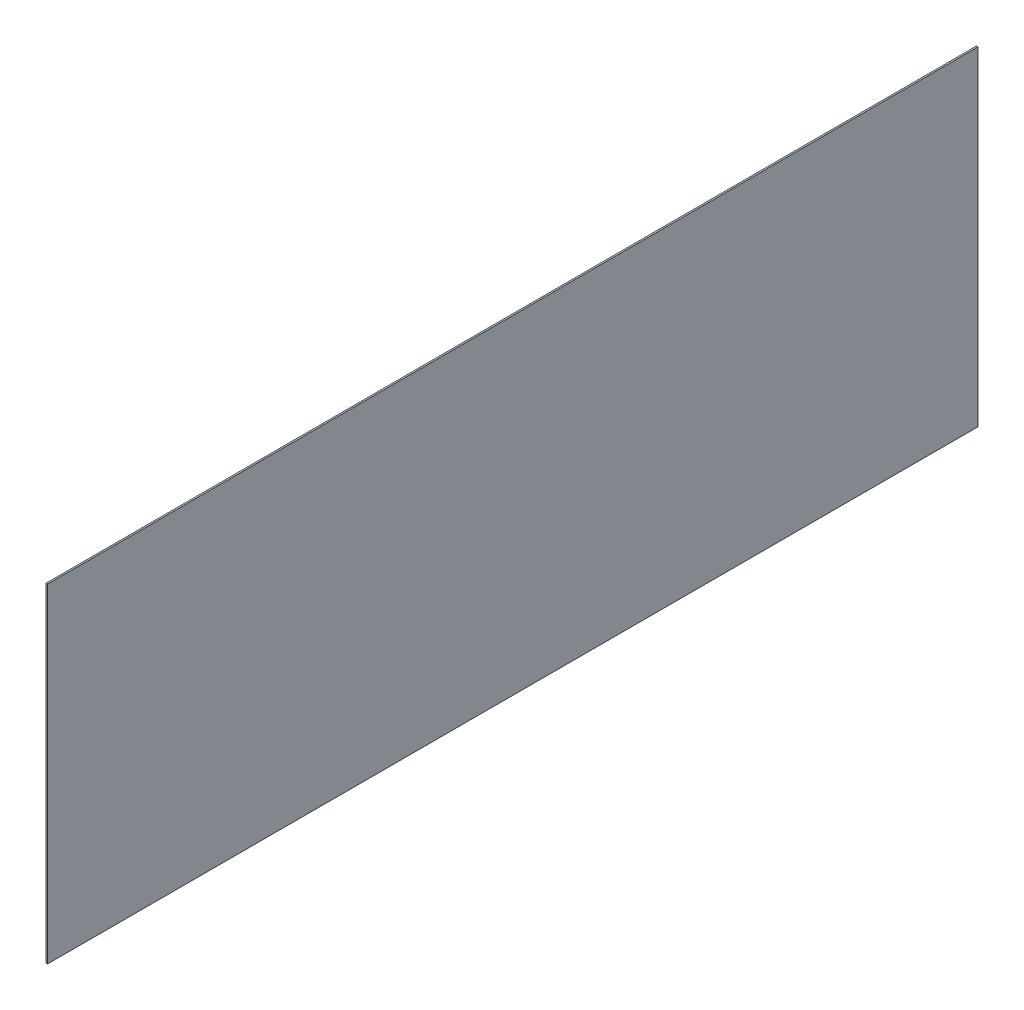
ISO-10303-21;
HEADER;
FILE_DESCRIPTION(('STEP AP214'),'2;1');
FILE_NAME('part.step','',(''),(''),'','','');
FILE_SCHEMA(('AUTOMOTIVE_DESIGN { 1 0 10303 214 1 1 1 1 }'));
ENDSEC;
DATA;
#1=APPLICATION_CONTEXT('core data for automotive mechanical design processes');
#2=APPLICATION_PROTOCOL_DEFINITION('international standard','automotive_design',2000,#1);
#3=PRODUCT_CONTEXT('',#1,'mechanical');
#4=PRODUCT('Part','Part','',(#3));
#5=PRODUCT_RELATED_PRODUCT_CATEGORY('part','',(#4));
#6=PRODUCT_DEFINITION_FORMATION('','',#4);
#7=PRODUCT_DEFINITION_CONTEXT('part definition',#1,'design');
#8=PRODUCT_DEFINITION('design','',#6,#7);
#9=PRODUCT_DEFINITION_SHAPE('','',#8);
#10=(LENGTH_UNIT() NAMED_UNIT(*) SI_UNIT(.MILLI.,.METRE.));
#11=(NAMED_UNIT(*) PLANE_ANGLE_UNIT() SI_UNIT($,.RADIAN.));
#12=(NAMED_UNIT(*) SI_UNIT($,.STERADIAN.) SOLID_ANGLE_UNIT());
#13=UNCERTAINTY_MEASURE_WITH_UNIT(LENGTH_MEASURE(1.E-05),#10,'distance_accuracy_value','');
#14=(GEOMETRIC_REPRESENTATION_CONTEXT(3) GLOBAL_UNCERTAINTY_ASSIGNED_CONTEXT((#13)) GLOBAL_UNIT_ASSIGNED_CONTEXT((#10,
#11,#12)) REPRESENTATION_CONTEXT('',''));
#15=CARTESIAN_POINT('',(0.,0.,0.));
#16=DIRECTION('',(0.,0.,1.));
#17=DIRECTION('',(1.,0.,0.));
#18=AXIS2_PLACEMENT_3D('',#15,#16,#17);
#19=CARTESIAN_POINT('',(10.,0.,0.));
#20=DIRECTION('',(0.,0.,-1.));
#21=DIRECTION('',(-1.,0.,0.));
#22=AXIS2_PLACEMENT_3D('',#19,#20,#21);
#23=PLANE('',#22);
#24=DIRECTION('',(0.,-1.,0.));
#25=VECTOR('',#24,1.);
#26=CARTESIAN_POINT('',(0.,0.,0.));
#27=LINE('',#26,#25);
#28=CARTESIAN_POINT('',(0.,2121.32,0.));
#29=VERTEX_POINT('',#28);
#30=CARTESIAN_POINT('',(0.,0.,0.));
#31=VERTEX_POINT('',#30);
#32=EDGE_CURVE('E107',#29,#31,#27,.T.);
#33=ORIENTED_EDGE('',*,*,#32,.T.);
#34=DIRECTION('',(-1.,0.,0.));
#35=VECTOR('',#34,1.);
#36=CARTESIAN_POINT('',(10.,0.,0.));
#37=LINE('',#36,#35);
#38=CARTESIAN_POINT('',(10.,0.,0.));
#39=VERTEX_POINT('',#38);
#40=EDGE_CURVE('E11',#39,#31,#37,.T.);
#41=ORIENTED_EDGE('',*,*,#40,.F.);
#42=DIRECTION('',(0.,-1.,0.));
#43=VECTOR('',#42,1.);
#44=CARTESIAN_POINT('',(10.,0.,0.));
#45=LINE('',#44,#43);
#46=CARTESIAN_POINT('',(10.,2121.32,0.));
#47=VERTEX_POINT('',#46);
#48=EDGE_CURVE('E91',#47,#39,#45,.T.);
#49=ORIENTED_EDGE('',*,*,#48,.F.);
#50=DIRECTION('',(-1.,0.,0.));
#51=VECTOR('',#50,1.);
#52=CARTESIAN_POINT('',(10.,2121.32,0.));
#53=LINE('',#52,#51);
#54=EDGE_CURVE('E103',#47,#29,#53,.T.);
#55=ORIENTED_EDGE('',*,*,#54,.T.);
#56=EDGE_LOOP('',(#33,#41,#49,#55));
#57=FACE_BOUND('',#56,.T.);
#58=ADVANCED_FACE('F39',(#57),#23,.F.);
#59=CARTESIAN_POINT('',(10.,0.,0.));
#60=DIRECTION('',(0.,1.,0.));
#61=DIRECTION('',(0.,0.,1.));
#62=AXIS2_PLACEMENT_3D('',#59,#60,#61);
#63=PLANE('',#62);
#64=DIRECTION('',(0.,0.,-1.));
#65=VECTOR('',#64,1.);
#66=CARTESIAN_POINT('',(0.,0.,0.));
#67=LINE('',#66,#65);
#68=CARTESIAN_POINT('',(0.,0.,-6000.));
#69=VERTEX_POINT('',#68);
#70=EDGE_CURVE('E96',#31,#69,#67,.T.);
#71=ORIENTED_EDGE('',*,*,#70,.T.);
#72=DIRECTION('',(-1.,0.,0.));
#73=VECTOR('',#72,1.);
#74=CARTESIAN_POINT('',(10.,0.,-6000.));
#75=LINE('',#74,#73);
#76=CARTESIAN_POINT('',(10.,0.,-6000.));
#77=VERTEX_POINT('',#76);
#78=EDGE_CURVE('E48',#77,#69,#75,.T.);
#79=ORIENTED_EDGE('',*,*,#78,.F.);
#80=DIRECTION('',(0.,0.,-1.));
#81=VECTOR('',#80,1.);
#82=CARTESIAN_POINT('',(10.,0.,0.));
#83=LINE('',#82,#81);
#84=EDGE_CURVE('E86',#39,#77,#83,.T.);
#85=ORIENTED_EDGE('',*,*,#84,.F.);
#86=ORIENTED_EDGE('',*,*,#40,.T.);
#87=EDGE_LOOP('',(#71,#79,#85,#86));
#88=FACE_BOUND('',#87,.T.);
#89=ADVANCED_FACE('F95',(#88),#63,.F.);
#90=CARTESIAN_POINT('',(10.,0.,-6000.));
#91=DIRECTION('',(0.,0.,1.));
#92=DIRECTION('',(1.,0.,0.));
#93=AXIS2_PLACEMENT_3D('',#90,#91,#92);
#94=PLANE('',#93);
#95=DIRECTION('',(0.,1.,0.));
#96=VECTOR('',#95,1.);
#97=CARTESIAN_POINT('',(0.,0.,-6000.));
#98=LINE('',#97,#96);
#99=CARTESIAN_POINT('',(0.,2121.32,-6000.));
#100=VERTEX_POINT('',#99);
#101=EDGE_CURVE('E73',#69,#100,#98,.T.);
#102=ORIENTED_EDGE('',*,*,#101,.T.);
#103=DIRECTION('',(-1.,0.,0.));
#104=VECTOR('',#103,1.);
#105=CARTESIAN_POINT('',(10.,2121.32,-6000.));
#106=LINE('',#105,#104);
#107=CARTESIAN_POINT('',(10.,2121.32,-6000.));
#108=VERTEX_POINT('',#107);
#109=EDGE_CURVE('E98',#108,#100,#106,.T.);
#110=ORIENTED_EDGE('',*,*,#109,.F.);
#111=DIRECTION('',(0.,1.,0.));
#112=VECTOR('',#111,1.);
#113=CARTESIAN_POINT('',(10.,0.,-6000.));
#114=LINE('',#113,#112);
#115=EDGE_CURVE('E89',#77,#108,#114,.T.);
#116=ORIENTED_EDGE('',*,*,#115,.F.);
#117=ORIENTED_EDGE('',*,*,#78,.T.);
#118=EDGE_LOOP('',(#102,#110,#116,#117));
#119=FACE_BOUND('',#118,.T.);
#120=ADVANCED_FACE('F99',(#119),#94,.F.);
#121=CARTESIAN_POINT('',(10.,2121.32,0.));
#122=DIRECTION('',(0.,-1.,0.));
#123=DIRECTION('',(0.,0.,-1.));
#124=AXIS2_PLACEMENT_3D('',#121,#122,#123);
#125=PLANE('',#124);
#126=DIRECTION('',(0.,0.,1.));
#127=VECTOR('',#126,1.);
#128=CARTESIAN_POINT('',(0.,2121.32,0.));
#129=LINE('',#128,#127);
#130=EDGE_CURVE('E79',#100,#29,#129,.T.);
#131=ORIENTED_EDGE('',*,*,#130,.T.);
#132=ORIENTED_EDGE('',*,*,#54,.F.);
#133=DIRECTION('',(0.,0.,1.));
#134=VECTOR('',#133,1.);
#135=CARTESIAN_POINT('',(10.,2121.32,0.));
#136=LINE('',#135,#134);
#137=EDGE_CURVE('E56',#108,#47,#136,.T.);
#138=ORIENTED_EDGE('',*,*,#137,.F.);
#139=ORIENTED_EDGE('',*,*,#109,.T.);
#140=EDGE_LOOP('',(#131,#132,#138,#139));
#141=FACE_BOUND('',#140,.T.);
#142=ADVANCED_FACE('F120',(#141),#125,.F.);
#143=CARTESIAN_POINT('',(10.,0.,0.));
#144=DIRECTION('',(-1.,0.,0.));
#145=DIRECTION('',(0.,0.,1.));
#146=AXIS2_PLACEMENT_3D('',#143,#144,#145);
#147=PLANE('',#146);
#148=ORIENTED_EDGE('',*,*,#48,.T.);
#149=ORIENTED_EDGE('',*,*,#84,.T.);
#150=ORIENTED_EDGE('',*,*,#115,.T.);
#151=ORIENTED_EDGE('',*,*,#137,.T.);
#152=EDGE_LOOP('',(#148,#149,#150,#151));
#153=FACE_BOUND('',#152,.T.);
#154=ADVANCED_FACE('F87',(#153),#147,.F.);
#155=CARTESIAN_POINT('',(0.,0.,0.));
#156=DIRECTION('',(-1.,0.,0.));
#157=DIRECTION('',(0.,0.,1.));
#158=AXIS2_PLACEMENT_3D('',#155,#156,#157);
#159=PLANE('',#158);
#160=ORIENTED_EDGE('',*,*,#32,.F.);
#161=ORIENTED_EDGE('',*,*,#130,.F.);
#162=ORIENTED_EDGE('',*,*,#101,.F.);
#163=ORIENTED_EDGE('',*,*,#70,.F.);
#164=EDGE_LOOP('',(#160,#161,#162,#163));
#165=FACE_BOUND('',#164,.T.);
#166=ADVANCED_FACE('F123',(#165),#159,.T.);
#167=CLOSED_SHELL('',(#58,#89,#120,#142,#154,#166));
#168=MANIFOLD_SOLID_BREP('B2',#167);
#169=ADVANCED_BREP_SHAPE_REPRESENTATION('',(#18,#168),#14);
#170=SHAPE_DEFINITION_REPRESENTATION(#9,#169);
ENDSEC;
END-ISO-10303-21;
